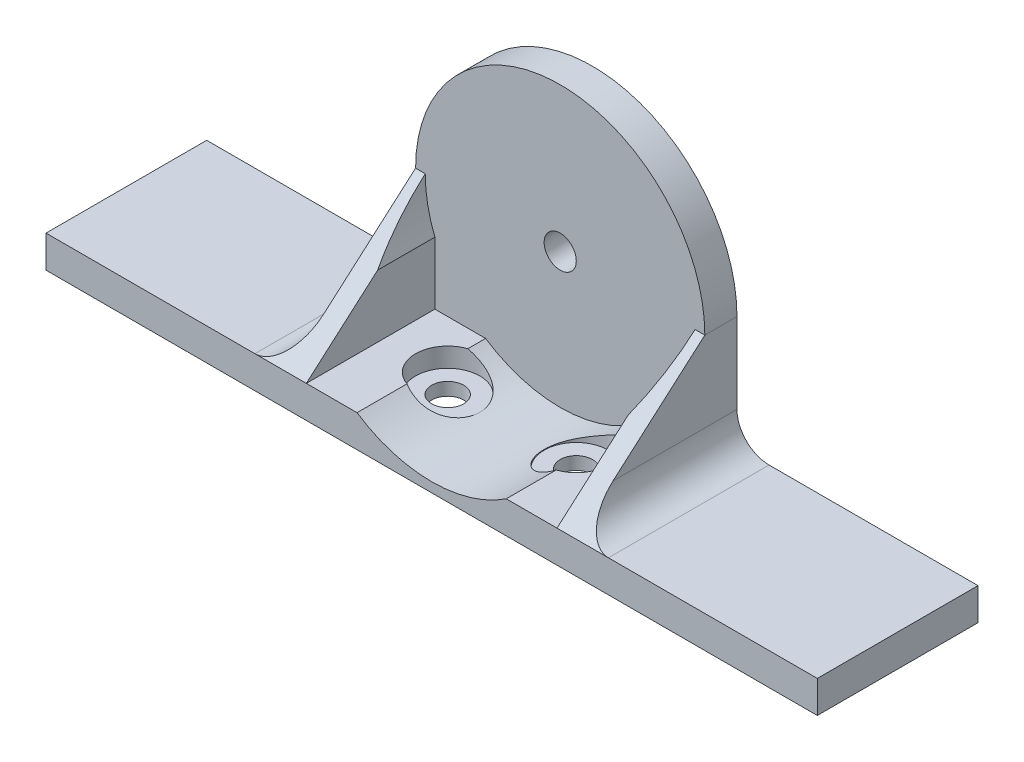
ISO-10303-21;
HEADER;
FILE_DESCRIPTION(('STEP AP214'),'2;1');
FILE_NAME('part.step','',(''),(''),'','','');
FILE_SCHEMA(('AUTOMOTIVE_DESIGN { 1 0 10303 214 1 1 1 1 }'));
ENDSEC;
DATA;
#1=APPLICATION_CONTEXT('core data for automotive mechanical design processes');
#2=APPLICATION_PROTOCOL_DEFINITION('international standard','automotive_design',2000,#1);
#3=PRODUCT_CONTEXT('',#1,'mechanical');
#4=PRODUCT('Part','Part','',(#3));
#5=PRODUCT_RELATED_PRODUCT_CATEGORY('part','',(#4));
#6=PRODUCT_DEFINITION_FORMATION('','',#4);
#7=PRODUCT_DEFINITION_CONTEXT('part definition',#1,'design');
#8=PRODUCT_DEFINITION('design','',#6,#7);
#9=PRODUCT_DEFINITION_SHAPE('','',#8);
#10=(LENGTH_UNIT() NAMED_UNIT(*) SI_UNIT(.MILLI.,.METRE.));
#11=(NAMED_UNIT(*) PLANE_ANGLE_UNIT() SI_UNIT($,.RADIAN.));
#12=(NAMED_UNIT(*) SI_UNIT($,.STERADIAN.) SOLID_ANGLE_UNIT());
#13=UNCERTAINTY_MEASURE_WITH_UNIT(LENGTH_MEASURE(1.E-05),#10,'distance_accuracy_value','');
#14=(GEOMETRIC_REPRESENTATION_CONTEXT(3) GLOBAL_UNCERTAINTY_ASSIGNED_CONTEXT((#13)) GLOBAL_UNIT_ASSIGNED_CONTEXT((#10,
#11,#12)) REPRESENTATION_CONTEXT('',''));
#15=CARTESIAN_POINT('',(0.,0.,0.));
#16=DIRECTION('',(0.,0.,1.));
#17=DIRECTION('',(1.,0.,0.));
#18=AXIS2_PLACEMENT_3D('',#15,#16,#17);
#19=CARTESIAN_POINT('',(-60.,-17.5,0.));
#20=DIRECTION('',(0.,-1.,0.));
#21=DIRECTION('',(0.,0.,-1.));
#22=AXIS2_PLACEMENT_3D('',#19,#20,#21);
#23=PLANE('',#22);
#24=DIRECTION('',(0.,0.,-1.));
#25=VECTOR('',#24,1.);
#26=CARTESIAN_POINT('',(-11.6081867662439,-17.5,25.));
#27=LINE('',#26,#25);
#28=CARTESIAN_POINT('',(-11.6081867662439,-17.5,5.));
#29=VERTEX_POINT('',#28);
#30=CARTESIAN_POINT('',(-11.6081867662439,-17.5,7.76568533736109));
#31=VERTEX_POINT('',#30);
#32=EDGE_CURVE('E327',#29,#31,#27,.F.);
#33=ORIENTED_EDGE('',*,*,#32,.F.);
#34=DIRECTION('',(-1.,0.,0.));
#35=VECTOR('',#34,1.);
#36=CARTESIAN_POINT('',(-22.5,-17.5,5.));
#37=LINE('',#36,#35);
#38=CARTESIAN_POINT('',(-19.5,-17.5,5.));
#39=VERTEX_POINT('',#38);
#40=EDGE_CURVE('E216',#29,#39,#37,.T.);
#41=ORIENTED_EDGE('',*,*,#40,.T.);
#42=DIRECTION('',(0.,0.,1.));
#43=VECTOR('',#42,1.);
#44=CARTESIAN_POINT('',(-19.5,-17.5,5.));
#45=LINE('',#44,#43);
#46=CARTESIAN_POINT('',(-19.5,-17.5,25.));
#47=VERTEX_POINT('',#46);
#48=EDGE_CURVE('E210',#39,#47,#45,.T.);
#49=ORIENTED_EDGE('',*,*,#48,.T.);
#50=DIRECTION('',(1.,0.,0.));
#51=VECTOR('',#50,1.);
#52=CARTESIAN_POINT('',(-60.,-17.5,25.));
#53=LINE('',#52,#51);
#54=CARTESIAN_POINT('',(-11.6081867662439,-17.5,25.));
#55=VERTEX_POINT('',#54);
#56=EDGE_CURVE('E254',#47,#55,#53,.T.);
#57=ORIENTED_EDGE('',*,*,#56,.T.);
#58=CARTESIAN_POINT('',(-11.6081867662439,-17.5,17.2343146626389));
#59=VERTEX_POINT('',#58);
#60=EDGE_CURVE('E438',#59,#55,#27,.F.);
#61=ORIENTED_EDGE('',*,*,#60,.F.);
#62=CARTESIAN_POINT('',(-10.,-17.5,12.5));
#63=DIRECTION('',(0.,-1.,0.));
#64=DIRECTION('',(0.,0.,-1.));
#65=AXIS2_PLACEMENT_3D('',#62,#63,#64);
#66=CIRCLE('',#65,5.);
#67=EDGE_CURVE('E221',#31,#59,#66,.F.);
#68=ORIENTED_EDGE('',*,*,#67,.F.);
#69=EDGE_LOOP('',(#33,#41,#49,#57,#61,#68));
#70=FACE_BOUND('',#69,.T.);
#71=ADVANCED_FACE('F39',(#70),#23,.F.);
#72=CARTESIAN_POINT('',(-10.,22.5,12.5));
#73=DIRECTION('',(0.,-1.,0.));
#74=DIRECTION('',(0.,0.,-1.));
#75=AXIS2_PLACEMENT_3D('',#72,#73,#74);
#76=CYLINDRICAL_SURFACE('',#75,5.);
#77=CARTESIAN_POINT('',(-10.,-20.5,12.5));
#78=DIRECTION('',(0.,-1.,0.));
#79=DIRECTION('',(0.,0.,-1.));
#80=AXIS2_PLACEMENT_3D('',#77,#78,#79);
#81=CIRCLE('',#80,5.);
#82=CARTESIAN_POINT('',(-10.,-20.5,7.50000000000001));
#83=VERTEX_POINT('',#82);
#84=EDGE_CURVE('E297',#83,#83,#81,.F.);
#85=ORIENTED_EDGE('',*,*,#84,.F.);
#86=EDGE_LOOP('',(#85));
#87=FACE_BOUND('',#86,.T.);
#88=CARTESIAN_POINT('',(-11.6081867662439,-17.5,7.76568533736109));
#89=CARTESIAN_POINT('',(-11.4375345080288,-17.6132401353149,7.70772130768553));
#90=CARTESIAN_POINT('',(-11.2630091727208,-17.7253712821928,7.65872713448555));
#91=CARTESIAN_POINT('',(-10.9073905192815,-17.9463735095857,7.57964568088784));
#92=CARTESIAN_POINT('',(-10.7262884992566,-18.0552398949962,7.5495844928465));
#93=CARTESIAN_POINT('',(-10.3580415413399,-18.2690086123099,7.50937786053708));
#94=CARTESIAN_POINT('',(-10.1708662604285,-18.3738824076262,7.49935618829404));
#95=CARTESIAN_POINT('',(-9.79351174021264,-18.5777564076377,7.50070725609247));
#96=CARTESIAN_POINT('',(-9.6033343937213,-18.6767601397546,7.51206701046821));
#97=CARTESIAN_POINT('',(-9.25075773438875,-18.8535505022338,7.55376363813038));
#98=CARTESIAN_POINT('',(-9.08846783724289,-18.9322929450681,7.58100054457933));
#99=CARTESIAN_POINT('',(-8.76494315087312,-19.0842260446967,7.65210866966691));
#100=CARTESIAN_POINT('',(-8.60370815558617,-19.1574178172472,7.69597653457618));
#101=CARTESIAN_POINT('',(-8.28469840408489,-19.2975132608588,7.80044589529361));
#102=CARTESIAN_POINT('',(-8.12691317396856,-19.3644388884449,7.86098578804088));
#103=CARTESIAN_POINT('',(-7.81620615605804,-19.4919241173014,7.99889828074545));
#104=CARTESIAN_POINT('',(-7.66328345381965,-19.5524849205346,8.0762676940362));
#105=CARTESIAN_POINT('',(-7.38613890562433,-19.658679552486,8.23509580740229));
#106=CARTESIAN_POINT('',(-7.26097613123558,-19.7052035715812,8.31432557386082));
#107=CARTESIAN_POINT('',(-7.01706893548761,-19.7933714543359,8.48450184266299));
#108=CARTESIAN_POINT('',(-6.89832364497143,-19.8350159797504,8.57544675268336));
#109=CARTESIAN_POINT('',(-6.66851697458718,-19.9134536211138,8.76854512361413));
#110=CARTESIAN_POINT('',(-6.55745836267542,-19.9502449937287,8.87070258825146));
#111=CARTESIAN_POINT('',(-6.34433274321556,-20.0190405423183,9.08547526066337));
#112=CARTESIAN_POINT('',(-6.24226525083162,-20.0510449764883,9.19808990387303));
#113=CARTESIAN_POINT('',(-6.05691625828496,-20.1077674345042,9.42244487188029));
#114=CARTESIAN_POINT('',(-5.972771375406,-20.1328802050712,9.53337383377719));
#115=CARTESIAN_POINT('',(-5.81368638670795,-20.1793935267141,9.76244139476929));
#116=CARTESIAN_POINT('',(-5.73874927165979,-20.2007928725597,9.880582317826));
#117=CARTESIAN_POINT('',(-5.59887579248388,-20.2400065508586,10.1230929850686));
#118=CARTESIAN_POINT('',(-5.53393228757043,-20.2578234459167,10.2474581967819));
#119=CARTESIAN_POINT('',(-5.41456655128792,-20.2900540963379,10.5016211109604));
#120=CARTESIAN_POINT('',(-5.36014817188253,-20.3044666061966,10.631420781256));
#121=CARTESIAN_POINT('',(-5.26379960284031,-20.3296537338692,10.891560155421));
#122=CARTESIAN_POINT('',(-5.22155033418001,-20.3405225366933,11.0217726985622));
#123=CARTESIAN_POINT('',(-5.14781803181256,-20.3593079260295,11.2854714023466));
#124=CARTESIAN_POINT('',(-5.11633889309744,-20.3672234445868,11.418958728643));
#125=CARTESIAN_POINT('',(-5.0644465597661,-20.3801888375641,11.6881530867144));
#126=CARTESIAN_POINT('',(-5.04402933062876,-20.3852397567978,11.8238592905874));
#127=CARTESIAN_POINT('',(-5.01441013436884,-20.3925458075517,12.0966157530786));
#128=CARTESIAN_POINT('',(-5.00521230735021,-20.3947999070146,12.2336664890524));
#129=CARTESIAN_POINT('',(-4.99814161551046,-20.3965338575992,12.5073591457146));
#130=CARTESIAN_POINT('',(-5.00020976376957,-20.3960281585772,12.6439994549546));
#131=CARTESIAN_POINT('',(-5.01551984682102,-20.3922686968898,12.9166651451284));
#132=CARTESIAN_POINT('',(-5.02876588654246,-20.3890139246641,13.0526902816961));
#133=CARTESIAN_POINT('',(-5.06631990869287,-20.3797148129057,13.3230548254907));
#134=CARTESIAN_POINT('',(-5.09062358050635,-20.3736715603982,13.4573948686699));
#135=CARTESIAN_POINT('',(-5.15009649845836,-20.3587191411752,13.7235350769801));
#136=CARTESIAN_POINT('',(-5.18526974685607,-20.3498089187704,13.8553342875356));
#137=CARTESIAN_POINT('',(-5.26616727488969,-20.3290242033995,14.1153466221362));
#138=CARTESIAN_POINT('',(-5.31188595020009,-20.3171512846735,14.2435616105655));
#139=CARTESIAN_POINT('',(-5.4134818585494,-20.2903170599912,14.4955823747452));
#140=CARTESIAN_POINT('',(-5.46936281483165,-20.2753546218278,14.6193865145069));
#141=CARTESIAN_POINT('',(-5.65152933389414,-20.2256302346052,14.9827401004168));
#142=CARTESIAN_POINT('',(-5.79243177170621,-20.1860083954562,15.2145282276361));
#143=CARTESIAN_POINT('',(-6.10844542778946,-20.0926350949264,15.6509820568319));
#144=CARTESIAN_POINT('',(-6.28364303590931,-20.03884783001,15.8555770271514));
#145=CARTESIAN_POINT('',(-6.66182804227834,-19.9163117701238,16.2319910811152));
#146=CARTESIAN_POINT('',(-6.86481753316591,-19.8475618482845,16.4038076943219));
#147=CARTESIAN_POINT('',(-7.2953061555763,-19.6934410535185,16.7138192936211));
#148=CARTESIAN_POINT('',(-7.52318061754952,-19.607793339698,16.8513535941981));
#149=CARTESIAN_POINT('',(-7.99255140863401,-19.4211966516131,17.0868420144358));
#150=CARTESIAN_POINT('',(-8.23404664127605,-19.3202489078972,17.1847993148693));
#151=CARTESIAN_POINT('',(-8.73707856620653,-19.0982509457631,17.3454749738797));
#152=CARTESIAN_POINT('',(-8.99898040677328,-18.976391756432,17.4059137845808));
#153=CARTESIAN_POINT('',(-9.5228322321516,-18.7189986330017,17.4842309207157));
#154=CARTESIAN_POINT('',(-9.78478175990088,-18.5834455777484,17.5020488527475));
#155=CARTESIAN_POINT('',(-10.1791972893186,-18.3686694064161,17.4986369075556));
#156=CARTESIAN_POINT('',(-10.3140767524584,-18.2932669608552,17.4919325021984));
#157=CARTESIAN_POINT('',(-10.5814699633379,-18.1399064863693,17.4678865762738));
#158=CARTESIAN_POINT('',(-10.7139833617684,-18.0619480848415,17.4505434982343));
#159=CARTESIAN_POINT('',(-10.9755497455679,-17.9042048075577,17.4056970625706));
#160=CARTESIAN_POINT('',(-11.1046126112647,-17.8244267215269,17.3782270421688));
#161=CARTESIAN_POINT('',(-11.3591778413429,-17.663291131667,17.313508438407));
#162=CARTESIAN_POINT('',(-11.4846816756527,-17.5819343039712,17.2762639591791));
#163=CARTESIAN_POINT('',(-11.6081867662439,-17.5,17.2343146626389));
#164=B_SPLINE_CURVE_WITH_KNOTS('',3,(#88,#89,#90,#91,#92,#93,#94,#95,#96,#97,#98,#99,#100,#101,
#102,#103,#104,#105,#106,#107,#108,#109,#110,#111,#112,#113,#114,#115,#116,#117,#118,#119,#120,
#121,#122,#123,#124,#125,#126,#127,#128,#129,#130,#131,#132,#133,#134,#135,#136,#137,#138,#139,
#140,#141,#142,#143,#144,#145,#146,#147,#148,#149,#150,#151,#152,#153,#154,#155,#156,#157,#158,
#159,#160,#161,#162,#163),.UNSPECIFIED.,.F.,.F.,(4,2,2,2,2,2,2,2,2,2,2,2,2,2,2,2,2,2,2,2,2,2,2,
2,2,2,2,2,2,2,2,2,2,2,2,2,2,4),(0.,0.638436207218285,1.27775035639756,1.92100111612904,
2.56386133390451,3.11035557236956,3.65673966566589,4.20113135121695,4.74542004589635,
5.21059635023806,5.67570949436088,6.14098926258487,6.60624392575077,7.03015998811005,
7.45421338050135,7.87796235063196,8.30186611129443,8.71335438276962,9.12499131109297,
9.53647800515841,9.94811649722532,10.357601791705,10.7672375295823,11.1767137151077,
11.5863408528264,11.9957507953609,12.4053110402904,13.223505498321,14.0437881522201,
14.8641326047381,15.6992397054322,16.5342796758609,17.4160633260542,18.2990957175071,
18.7627702133888,19.2265126061389,19.6887418266236,20.1507772744256),.UNSPECIFIED.);
#165=EDGE_CURVE('E430',#31,#59,#164,.T.);
#166=ORIENTED_EDGE('',*,*,#165,.F.);
#167=ORIENTED_EDGE('',*,*,#67,.T.);
#168=EDGE_LOOP('',(#166,#167));
#169=FACE_BOUND('',#168,.T.);
#170=ADVANCED_FACE('F385',(#87,#169),#76,.F.);
#171=CARTESIAN_POINT('',(10.,22.5,12.5));
#172=DIRECTION('',(0.,-1.,0.));
#173=DIRECTION('',(0.,0.,-1.));
#174=AXIS2_PLACEMENT_3D('',#171,#172,#173);
#175=CYLINDRICAL_SURFACE('',#174,5.00000000000001);
#176=CARTESIAN_POINT('',(9.99999999999999,-20.5,12.5));
#177=DIRECTION('',(0.,-1.,0.));
#178=DIRECTION('',(0.,0.,1.));
#179=AXIS2_PLACEMENT_3D('',#176,#177,#178);
#180=CIRCLE('',#179,5.);
#181=CARTESIAN_POINT('',(9.99999999999999,-20.5,17.5));
#182=VERTEX_POINT('',#181);
#183=EDGE_CURVE('E259',#182,#182,#180,.T.);
#184=ORIENTED_EDGE('',*,*,#183,.T.);
#185=EDGE_LOOP('',(#184));
#186=FACE_BOUND('',#185,.T.);
#187=CARTESIAN_POINT('',(11.6081867662439,-17.5,17.2343146626389));
#188=CARTESIAN_POINT('',(11.4375345080288,-17.6132401353149,17.2922786923145));
#189=CARTESIAN_POINT('',(11.2630091727208,-17.7253712821928,17.3412728655145));
#190=CARTESIAN_POINT('',(10.9073905192815,-17.9463735095857,17.4203543191122));
#191=CARTESIAN_POINT('',(10.7262884992566,-18.0552398949962,17.4504155071535));
#192=CARTESIAN_POINT('',(10.3580415413399,-18.2690086123099,17.4906221394629));
#193=CARTESIAN_POINT('',(10.1708662604285,-18.3738824076262,17.500643811706));
#194=CARTESIAN_POINT('',(9.79351174021264,-18.5777564076377,17.4992927439076));
#195=CARTESIAN_POINT('',(9.60333439372129,-18.6767601397546,17.4879329895318));
#196=CARTESIAN_POINT('',(9.25075773438875,-18.8535505022338,17.4462363618696));
#197=CARTESIAN_POINT('',(9.08846783724288,-18.9322929450681,17.4189994554207));
#198=CARTESIAN_POINT('',(8.76494315087312,-19.0842260446967,17.3478913303331));
#199=CARTESIAN_POINT('',(8.60370815558616,-19.1574178172472,17.3040234654238));
#200=CARTESIAN_POINT('',(8.28469840408488,-19.2975132608588,17.1995541047064));
#201=CARTESIAN_POINT('',(8.12691317396855,-19.3644388884449,17.1390142119591));
#202=CARTESIAN_POINT('',(7.81620615605803,-19.4919241173014,17.0011017192546));
#203=CARTESIAN_POINT('',(7.66328345381964,-19.5524849205346,16.9237323059638));
#204=CARTESIAN_POINT('',(7.38613890562432,-19.658679552486,16.7649041925977));
#205=CARTESIAN_POINT('',(7.26097613123557,-19.7052035715812,16.6856744261392));
#206=CARTESIAN_POINT('',(7.0170689354876,-19.7933714543359,16.515498157337));
#207=CARTESIAN_POINT('',(6.89832364497142,-19.8350159797504,16.4245532473167));
#208=CARTESIAN_POINT('',(6.66851697458717,-19.9134536211138,16.2314548763859));
#209=CARTESIAN_POINT('',(6.55745836267541,-19.9502449937287,16.1292974117486));
#210=CARTESIAN_POINT('',(6.34433274321555,-20.0190405423183,15.9145247393367));
#211=CARTESIAN_POINT('',(6.24226525083161,-20.0510449764883,15.801910096127));
#212=CARTESIAN_POINT('',(6.05691625828495,-20.1077674345042,15.5775551281197));
#213=CARTESIAN_POINT('',(5.97277137540599,-20.1328802050712,15.4666261662228));
#214=CARTESIAN_POINT('',(5.81368638670794,-20.179393526714,15.2375586052307));
#215=CARTESIAN_POINT('',(5.73874927165978,-20.2007928725597,15.119417682174));
#216=CARTESIAN_POINT('',(5.59887579248387,-20.2400065508586,14.8769070149314));
#217=CARTESIAN_POINT('',(5.53393228757042,-20.2578234459167,14.7525418032181));
#218=CARTESIAN_POINT('',(5.41456655128791,-20.2900540963379,14.4983788890396));
#219=CARTESIAN_POINT('',(5.36014817188252,-20.3044666061966,14.368579218744));
#220=CARTESIAN_POINT('',(5.2637996028403,-20.3296537338692,14.108439844579));
#221=CARTESIAN_POINT('',(5.22155033418,-20.3405225366933,13.9782273014378));
#222=CARTESIAN_POINT('',(5.14781803181255,-20.3593079260295,13.7145285976534));
#223=CARTESIAN_POINT('',(5.11633889309743,-20.3672234445868,13.581041271357));
#224=CARTESIAN_POINT('',(5.06444655976609,-20.3801888375641,13.3118469132857));
#225=CARTESIAN_POINT('',(5.04402933062875,-20.3852397567978,13.1761407094126));
#226=CARTESIAN_POINT('',(5.01441013436883,-20.3925458075517,12.9033842469214));
#227=CARTESIAN_POINT('',(5.0052123073502,-20.3947999070146,12.7663335109476));
#228=CARTESIAN_POINT('',(4.99814161551045,-20.3965338575992,12.4926408542854));
#229=CARTESIAN_POINT('',(5.00020976376956,-20.3960281585773,12.3560005450454));
#230=CARTESIAN_POINT('',(5.01551984682102,-20.3922686968898,12.0833348548716));
#231=CARTESIAN_POINT('',(5.02876588654245,-20.3890139246641,11.9473097183039));
#232=CARTESIAN_POINT('',(5.06631990869286,-20.3797148129057,11.6769451745093));
#233=CARTESIAN_POINT('',(5.09062358050635,-20.3736715603982,11.5426051313301));
#234=CARTESIAN_POINT('',(5.15009649845836,-20.3587191411752,11.2764649230199));
#235=CARTESIAN_POINT('',(5.18526974685606,-20.3498089187704,11.1446657124644));
#236=CARTESIAN_POINT('',(5.26616727488968,-20.3290242033995,10.8846533778638));
#237=CARTESIAN_POINT('',(5.31188595020009,-20.3171512846735,10.7564383894345));
#238=CARTESIAN_POINT('',(5.4134818585494,-20.2903170599912,10.5044176252548));
#239=CARTESIAN_POINT('',(5.46936281483165,-20.2753546218278,10.3806134854931));
#240=CARTESIAN_POINT('',(5.65152933389414,-20.2256302346052,10.0172598995832));
#241=CARTESIAN_POINT('',(5.79243177170621,-20.1860083954562,9.78547177236387));
#242=CARTESIAN_POINT('',(6.10844542778946,-20.0926350949264,9.34901794316813));
#243=CARTESIAN_POINT('',(6.28364303590931,-20.03884783001,9.14442297284861));
#244=CARTESIAN_POINT('',(6.66182804227834,-19.9163117701238,8.7680089188848));
#245=CARTESIAN_POINT('',(6.86481753316591,-19.8475618482845,8.59619230567808));
#246=CARTESIAN_POINT('',(7.2953061555763,-19.6934410535185,8.2861807063789));
#247=CARTESIAN_POINT('',(7.52318061754953,-19.607793339698,8.14864640580191));
#248=CARTESIAN_POINT('',(7.99255140863401,-19.4211966516131,7.91315798556417));
#249=CARTESIAN_POINT('',(8.23404664127605,-19.3202489078972,7.81520068513071));
#250=CARTESIAN_POINT('',(8.73707856620654,-19.0982509457631,7.65452502612029));
#251=CARTESIAN_POINT('',(8.9989804067733,-18.976391756432,7.59408621541925));
#252=CARTESIAN_POINT('',(9.52283223215161,-18.7189986330017,7.51576907928427));
#253=CARTESIAN_POINT('',(9.78478175990089,-18.5834455777483,7.49795114725246));
#254=CARTESIAN_POINT('',(10.1791972893186,-18.3686694064161,7.50136309244446));
#255=CARTESIAN_POINT('',(10.3140767524585,-18.2932669608552,7.50806749780165));
#256=CARTESIAN_POINT('',(10.5814699633379,-18.1399064863693,7.53211342372616));
#257=CARTESIAN_POINT('',(10.7139833617684,-18.0619480848415,7.54945650176571));
#258=CARTESIAN_POINT('',(10.9755497455679,-17.9042048075577,7.59430293742945));
#259=CARTESIAN_POINT('',(11.1046126112647,-17.8244267215269,7.62177295783118));
#260=CARTESIAN_POINT('',(11.359177841343,-17.663291131667,7.68649156159302));
#261=CARTESIAN_POINT('',(11.4846816756527,-17.5819343039712,7.72373604082095));
#262=CARTESIAN_POINT('',(11.6081867662439,-17.5,7.76568533736108));
#263=B_SPLINE_CURVE_WITH_KNOTS('',3,(#187,#188,#189,#190,#191,#192,#193,#194,#195,#196,#197,
#198,#199,#200,#201,#202,#203,#204,#205,#206,#207,#208,#209,#210,#211,#212,#213,#214,#215,#216,
#217,#218,#219,#220,#221,#222,#223,#224,#225,#226,#227,#228,#229,#230,#231,#232,#233,#234,#235,
#236,#237,#238,#239,#240,#241,#242,#243,#244,#245,#246,#247,#248,#249,#250,#251,#252,#253,#254,
#255,#256,#257,#258,#259,#260,#261,#262),.UNSPECIFIED.,.F.,.F.,(4,2,2,2,2,2,2,2,2,2,2,2,2,2,2,2,
2,2,2,2,2,2,2,2,2,2,2,2,2,2,2,2,2,2,2,2,2,4),(0.,0.638436207218287,1.27775035639756,
1.92100111612905,2.56386133390451,3.11035557236956,3.6567396656659,4.20113135121696,
4.74542004589636,5.21059635023808,5.67570949436089,6.14098926258488,6.60624392575078,
7.03015998811007,7.45421338050137,7.87796235063198,8.30186611129445,8.71335438276964,
9.12499131109298,9.53647800515842,9.94811649722534,10.357601791705,10.7672375295823,
11.1767137151078,11.5863408528264,11.9957507953609,12.4053110402904,13.2235054983211,
14.0437881522201,14.8641326047381,15.6992397054323,16.5342796758609,17.4160633260542,
18.2990957175072,18.7627702133889,19.2265126061389,19.6887418266236,20.1507772744257),.UNSPECIFIED.);
#264=CARTESIAN_POINT('',(11.6081867662439,-17.5,17.2343146626389));
#265=VERTEX_POINT('',#264);
#266=CARTESIAN_POINT('',(11.6081867662439,-17.5,7.76568533736106));
#267=VERTEX_POINT('',#266);
#268=EDGE_CURVE('E440',#265,#267,#263,.T.);
#269=ORIENTED_EDGE('',*,*,#268,.F.);
#270=CARTESIAN_POINT('',(10.,-17.5,12.5));
#271=DIRECTION('',(0.,-1.,0.));
#272=DIRECTION('',(0.,0.,-1.));
#273=AXIS2_PLACEMENT_3D('',#270,#271,#272);
#274=CIRCLE('',#273,5.00000000000001);
#275=EDGE_CURVE('E300',#265,#267,#274,.F.);
#276=ORIENTED_EDGE('',*,*,#275,.T.);
#277=EDGE_LOOP('',(#269,#276));
#278=FACE_BOUND('',#277,.T.);
#279=ADVANCED_FACE('F392',(#186,#278),#175,.F.);
#280=CARTESIAN_POINT('',(60.,-17.5,25.));
#281=DIRECTION('',(0.,-1.,0.));
#282=DIRECTION('',(0.,0.,-1.));
#283=AXIS2_PLACEMENT_3D('',#280,#281,#282);
#284=PLANE('',#283);
#285=DIRECTION('',(0.,0.,-1.));
#286=VECTOR('',#285,1.);
#287=CARTESIAN_POINT('',(11.6081867662439,-17.5,25.));
#288=LINE('',#287,#286);
#289=CARTESIAN_POINT('',(11.6081867662439,-17.5,25.));
#290=VERTEX_POINT('',#289);
#291=EDGE_CURVE('E439',#290,#265,#288,.T.);
#292=ORIENTED_EDGE('',*,*,#291,.F.);
#293=DIRECTION('',(-1.,0.,0.));
#294=VECTOR('',#293,1.);
#295=CARTESIAN_POINT('',(60.,-17.5,25.));
#296=LINE('',#295,#294);
#297=CARTESIAN_POINT('',(19.5,-17.5,25.));
#298=VERTEX_POINT('',#297);
#299=EDGE_CURVE('E234',#298,#290,#296,.T.);
#300=ORIENTED_EDGE('',*,*,#299,.F.);
#301=DIRECTION('',(0.,0.,-1.));
#302=VECTOR('',#301,1.);
#303=CARTESIAN_POINT('',(19.5,-17.5,25.));
#304=LINE('',#303,#302);
#305=CARTESIAN_POINT('',(19.5,-17.5,5.));
#306=VERTEX_POINT('',#305);
#307=EDGE_CURVE('E195',#298,#306,#304,.T.);
#308=ORIENTED_EDGE('',*,*,#307,.T.);
#309=CARTESIAN_POINT('',(11.6081867662439,-17.5,5.));
#310=VERTEX_POINT('',#309);
#311=EDGE_CURVE('E220',#306,#310,#37,.T.);
#312=ORIENTED_EDGE('',*,*,#311,.T.);
#313=EDGE_CURVE('E781',#267,#310,#288,.T.);
#314=ORIENTED_EDGE('',*,*,#313,.F.);
#315=ORIENTED_EDGE('',*,*,#275,.F.);
#316=EDGE_LOOP('',(#292,#300,#308,#312,#314,#315));
#317=FACE_BOUND('',#316,.T.);
#318=ADVANCED_FACE('F464',(#317),#284,.F.);
#319=CARTESIAN_POINT('',(-19.5,-17.5,25.));
#320=DIRECTION('',(0.,0.752576694706878,0.658504607868518));
#321=DIRECTION('',(0.,-0.658504607868518,0.752576694706878));
#322=AXIS2_PLACEMENT_3D('',#319,#320,#321);
#323=PLANE('',#322);
#324=DIRECTION('',(0.,0.658504607868518,-0.752576694706878));
#325=VECTOR('',#324,1.);
#326=CARTESIAN_POINT('',(-19.5,-17.5,25.));
#327=LINE('',#326,#325);
#328=CARTESIAN_POINT('',(-19.5,-7.79422863405994,13.9076898674971));
#329=VERTEX_POINT('',#328);
#330=EDGE_CURVE('E204',#47,#329,#327,.T.);
#331=ORIENTED_EDGE('',*,*,#330,.T.);
#332=CARTESIAN_POINT('',(0.,0.,5.));
#333=DIRECTION('',(0.,0.752576694706878,0.658504607868518));
#334=DIRECTION('',(0.,0.658504607868518,-0.752576694706878));
#335=AXIS2_PLACEMENT_3D('',#332,#333,#334);
#336=ELLIPSE('',#335,31.890437438204,21.);
#337=CARTESIAN_POINT('',(-21.,0.,5.));
#338=VERTEX_POINT('',#337);
#339=EDGE_CURVE('E369',#329,#338,#336,.F.);
#340=ORIENTED_EDGE('',*,*,#339,.T.);
#341=DIRECTION('',(-1.,0.,0.));
#342=VECTOR('',#341,1.);
#343=CARTESIAN_POINT('',(-19.5,0.,5.));
#344=LINE('',#343,#342);
#345=CARTESIAN_POINT('',(-22.5,0.,5.));
#346=VERTEX_POINT('',#345);
#347=EDGE_CURVE('E213',#338,#346,#344,.T.);
#348=ORIENTED_EDGE('',*,*,#347,.T.);
#349=DIRECTION('',(0.,0.658504607868518,-0.752576694706878));
#350=VECTOR('',#349,1.);
#351=CARTESIAN_POINT('',(-22.5,-17.5,25.));
#352=LINE('',#351,#350);
#353=CARTESIAN_POINT('',(-22.5,-12.5,19.2857142857143));
#354=VERTEX_POINT('',#353);
#355=EDGE_CURVE('E198',#354,#346,#352,.T.);
#356=ORIENTED_EDGE('',*,*,#355,.F.);
#357=CARTESIAN_POINT('',(-27.5,-12.5,19.2857142857143));
#358=DIRECTION('',(0.,0.752576694706878,0.658504607868518));
#359=DIRECTION('',(0.,-0.658504607868518,0.752576694706878));
#360=AXIS2_PLACEMENT_3D('',#357,#358,#359);
#361=ELLIPSE('',#360,7.59296129481047,5.);
#362=CARTESIAN_POINT('',(-27.5,-17.5,25.));
#363=VERTEX_POINT('',#362);
#364=EDGE_CURVE('E316',#354,#363,#361,.F.);
#365=ORIENTED_EDGE('',*,*,#364,.T.);
#366=DIRECTION('',(-1.,0.,0.));
#367=VECTOR('',#366,1.);
#368=CARTESIAN_POINT('',(-19.5,-17.5,25.));
#369=LINE('',#368,#367);
#370=EDGE_CURVE('E55',#47,#363,#369,.T.);
#371=ORIENTED_EDGE('',*,*,#370,.F.);
#372=EDGE_LOOP('',(#331,#340,#348,#356,#365,#371));
#373=FACE_BOUND('',#372,.T.);
#374=ADVANCED_FACE('F365',(#373),#323,.T.);
#375=CARTESIAN_POINT('',(-19.5,0.,0.));
#376=DIRECTION('',(-1.,0.,0.));
#377=DIRECTION('',(0.,0.,1.));
#378=AXIS2_PLACEMENT_3D('',#375,#376,#377);
#379=PLANE('',#378);
#380=DIRECTION('',(0.,0.,-1.));
#381=VECTOR('',#380,1.);
#382=CARTESIAN_POINT('',(-19.5,-7.79422863405994,25.));
#383=LINE('',#382,#381);
#384=CARTESIAN_POINT('',(-19.5,-7.79422863405994,5.));
#385=VERTEX_POINT('',#384);
#386=EDGE_CURVE('E173',#329,#385,#383,.T.);
#387=ORIENTED_EDGE('',*,*,#386,.F.);
#388=ORIENTED_EDGE('',*,*,#330,.F.);
#389=ORIENTED_EDGE('',*,*,#48,.F.);
#390=DIRECTION('',(0.,-1.,0.));
#391=VECTOR('',#390,1.);
#392=CARTESIAN_POINT('',(-19.5,0.,5.));
#393=LINE('',#392,#391);
#394=EDGE_CURVE('E207',#385,#39,#393,.T.);
#395=ORIENTED_EDGE('',*,*,#394,.F.);
#396=EDGE_LOOP('',(#387,#388,#389,#395));
#397=FACE_BOUND('',#396,.T.);
#398=ADVANCED_FACE('F458',(#397),#379,.F.);
#399=CARTESIAN_POINT('',(19.5,0.,5.));
#400=DIRECTION('',(0.,0.752576694706878,0.658504607868518));
#401=DIRECTION('',(0.,-0.658504607868518,0.752576694706878));
#402=AXIS2_PLACEMENT_3D('',#399,#400,#401);
#403=PLANE('',#402);
#404=DIRECTION('',(1.,0.,0.));
#405=VECTOR('',#404,1.);
#406=CARTESIAN_POINT('',(19.5,0.,5.));
#407=LINE('',#406,#405);
#408=CARTESIAN_POINT('',(21.,0.,5.));
#409=VERTEX_POINT('',#408);
#410=CARTESIAN_POINT('',(22.5,0.,5.));
#411=VERTEX_POINT('',#410);
#412=EDGE_CURVE('E182',#409,#411,#407,.T.);
#413=ORIENTED_EDGE('',*,*,#412,.F.);
#414=CARTESIAN_POINT('',(0.,0.,5.));
#415=DIRECTION('',(0.,0.752576694706878,0.658504607868518));
#416=DIRECTION('',(0.,0.658504607868518,-0.752576694706878));
#417=AXIS2_PLACEMENT_3D('',#414,#415,#416);
#418=ELLIPSE('',#417,31.890437438204,21.);
#419=CARTESIAN_POINT('',(19.5,-7.79422863405994,13.9076898674971));
#420=VERTEX_POINT('',#419);
#421=EDGE_CURVE('E164',#409,#420,#418,.F.);
#422=ORIENTED_EDGE('',*,*,#421,.T.);
#423=DIRECTION('',(0.,-0.658504607868518,0.752576694706878));
#424=VECTOR('',#423,1.);
#425=CARTESIAN_POINT('',(19.5,0.,5.));
#426=LINE('',#425,#424);
#427=EDGE_CURVE('E200',#420,#298,#426,.T.);
#428=ORIENTED_EDGE('',*,*,#427,.T.);
#429=DIRECTION('',(1.,0.,0.));
#430=VECTOR('',#429,1.);
#431=CARTESIAN_POINT('',(19.5,-17.5,25.));
#432=LINE('',#431,#430);
#433=CARTESIAN_POINT('',(27.5,-17.5,25.));
#434=VERTEX_POINT('',#433);
#435=EDGE_CURVE('E194',#298,#434,#432,.T.);
#436=ORIENTED_EDGE('',*,*,#435,.T.);
#437=CARTESIAN_POINT('',(27.5,-12.5,19.2857142857143));
#438=DIRECTION('',(0.,0.752576694706878,0.658504607868518));
#439=DIRECTION('',(0.,0.658504607868518,-0.752576694706878));
#440=AXIS2_PLACEMENT_3D('',#437,#438,#439);
#441=ELLIPSE('',#440,7.59296129481047,5.);
#442=CARTESIAN_POINT('',(22.5,-12.5,19.2857142857143));
#443=VERTEX_POINT('',#442);
#444=EDGE_CURVE('E48',#434,#443,#441,.F.);
#445=ORIENTED_EDGE('',*,*,#444,.T.);
#446=DIRECTION('',(0.,-0.658504607868518,0.752576694706878));
#447=VECTOR('',#446,1.);
#448=CARTESIAN_POINT('',(22.5,0.,5.));
#449=LINE('',#448,#447);
#450=EDGE_CURVE('E193',#411,#443,#449,.T.);
#451=ORIENTED_EDGE('',*,*,#450,.F.);
#452=EDGE_LOOP('',(#413,#422,#428,#436,#445,#451));
#453=FACE_BOUND('',#452,.T.);
#454=ADVANCED_FACE('F191',(#453),#403,.T.);
#455=CARTESIAN_POINT('',(19.5,0.,0.));
#456=DIRECTION('',(-1.,0.,0.));
#457=DIRECTION('',(0.,0.,1.));
#458=AXIS2_PLACEMENT_3D('',#455,#456,#457);
#459=PLANE('',#458);
#460=ORIENTED_EDGE('',*,*,#427,.F.);
#461=DIRECTION('',(0.,0.,-1.));
#462=VECTOR('',#461,1.);
#463=CARTESIAN_POINT('',(19.5,-7.79422863405994,25.));
#464=LINE('',#463,#462);
#465=CARTESIAN_POINT('',(19.5,-7.79422863405994,5.));
#466=VERTEX_POINT('',#465);
#467=EDGE_CURVE('E169',#420,#466,#464,.T.);
#468=ORIENTED_EDGE('',*,*,#467,.T.);
#469=DIRECTION('',(0.,1.,0.));
#470=VECTOR('',#469,1.);
#471=CARTESIAN_POINT('',(19.5,-17.5,5.));
#472=LINE('',#471,#470);
#473=EDGE_CURVE('E186',#306,#466,#472,.T.);
#474=ORIENTED_EDGE('',*,*,#473,.F.);
#475=ORIENTED_EDGE('',*,*,#307,.F.);
#476=EDGE_LOOP('',(#460,#468,#474,#475));
#477=FACE_BOUND('',#476,.T.);
#478=ADVANCED_FACE('F451',(#477),#459,.T.);
#479=DIRECTION('',(-1.,0.,0.));
#480=VECTOR('',#479,1.);
#481=CARTESIAN_POINT('',(60.,-17.5,0.));
#482=LINE('',#481,#480);
#483=CARTESIAN_POINT('',(60.,-17.5,0.));
#484=VERTEX_POINT('',#483);
#485=CARTESIAN_POINT('',(27.5,-17.5,0.));
#486=VERTEX_POINT('',#485);
#487=EDGE_CURVE('E238',#484,#486,#482,.T.);
#488=ORIENTED_EDGE('',*,*,#487,.T.);
#489=DIRECTION('',(0.,0.,1.));
#490=VECTOR('',#489,1.);
#491=CARTESIAN_POINT('',(27.5,-17.5,25.));
#492=LINE('',#491,#490);
#493=EDGE_CURVE('E309',#486,#434,#492,.T.);
#494=ORIENTED_EDGE('',*,*,#493,.T.);
#495=CARTESIAN_POINT('',(60.,-17.5,25.));
#496=VERTEX_POINT('',#495);
#497=EDGE_CURVE('E235',#496,#434,#296,.T.);
#498=ORIENTED_EDGE('',*,*,#497,.F.);
#499=DIRECTION('',(0.,0.,1.));
#500=VECTOR('',#499,1.);
#501=CARTESIAN_POINT('',(60.,-17.5,25.));
#502=LINE('',#501,#500);
#503=EDGE_CURVE('E232',#484,#496,#502,.T.);
#504=ORIENTED_EDGE('',*,*,#503,.F.);
#505=EDGE_LOOP('',(#488,#494,#498,#504));
#506=FACE_BOUND('',#505,.T.);
#507=ADVANCED_FACE('F336',(#506),#284,.F.);
#508=CARTESIAN_POINT('',(22.5,0.,25.));
#509=DIRECTION('',(-1.,0.,0.));
#510=DIRECTION('',(0.,0.,1.));
#511=AXIS2_PLACEMENT_3D('',#508,#509,#510);
#512=PLANE('',#511);
#513=ORIENTED_EDGE('',*,*,#450,.T.);
#514=DIRECTION('',(0.,0.,1.));
#515=VECTOR('',#514,1.);
#516=CARTESIAN_POINT('',(22.5,-12.5,0.));
#517=LINE('',#516,#515);
#518=CARTESIAN_POINT('',(22.5,-12.5,0.));
#519=VERTEX_POINT('',#518);
#520=EDGE_CURVE('E312',#443,#519,#517,.F.);
#521=ORIENTED_EDGE('',*,*,#520,.T.);
#522=DIRECTION('',(0.,1.,0.));
#523=VECTOR('',#522,1.);
#524=CARTESIAN_POINT('',(22.5,0.,0.));
#525=LINE('',#524,#523);
#526=CARTESIAN_POINT('',(22.5,0.,0.));
#527=VERTEX_POINT('',#526);
#528=EDGE_CURVE('E284',#519,#527,#525,.T.);
#529=ORIENTED_EDGE('',*,*,#528,.T.);
#530=DIRECTION('',(0.,0.,-1.));
#531=VECTOR('',#530,1.);
#532=CARTESIAN_POINT('',(22.5,0.,25.));
#533=LINE('',#532,#531);
#534=EDGE_CURVE('E291',#411,#527,#533,.T.);
#535=ORIENTED_EDGE('',*,*,#534,.F.);
#536=EDGE_LOOP('',(#513,#521,#529,#535));
#537=FACE_BOUND('',#536,.T.);
#538=ADVANCED_FACE('F325',(#537),#512,.F.);
#539=CARTESIAN_POINT('',(-22.5,0.,25.));
#540=DIRECTION('',(1.,0.,0.));
#541=DIRECTION('',(0.,0.,-1.));
#542=AXIS2_PLACEMENT_3D('',#539,#540,#541);
#543=PLANE('',#542);
#544=DIRECTION('',(0.,-1.,0.));
#545=VECTOR('',#544,1.);
#546=CARTESIAN_POINT('',(-22.5,0.,0.));
#547=LINE('',#546,#545);
#548=CARTESIAN_POINT('',(-22.5,0.,0.));
#549=VERTEX_POINT('',#548);
#550=CARTESIAN_POINT('',(-22.5,-12.5,0.));
#551=VERTEX_POINT('',#550);
#552=EDGE_CURVE('E280',#549,#551,#547,.T.);
#553=ORIENTED_EDGE('',*,*,#552,.T.);
#554=DIRECTION('',(0.,0.,-1.));
#555=VECTOR('',#554,1.);
#556=CARTESIAN_POINT('',(-22.5,-12.5,25.));
#557=LINE('',#556,#555);
#558=EDGE_CURVE('E307',#551,#354,#557,.F.);
#559=ORIENTED_EDGE('',*,*,#558,.T.);
#560=ORIENTED_EDGE('',*,*,#355,.T.);
#561=DIRECTION('',(0.,0.,-1.));
#562=VECTOR('',#561,1.);
#563=CARTESIAN_POINT('',(-22.5,0.,25.));
#564=LINE('',#563,#562);
#565=EDGE_CURVE('E283',#346,#549,#564,.T.);
#566=ORIENTED_EDGE('',*,*,#565,.T.);
#567=EDGE_LOOP('',(#553,#559,#560,#566));
#568=FACE_BOUND('',#567,.T.);
#569=ADVANCED_FACE('F359',(#568),#543,.F.);
#570=CARTESIAN_POINT('',(0.,0.,25.));
#571=DIRECTION('',(0.,0.,-1.));
#572=DIRECTION('',(-1.,0.,0.));
#573=AXIS2_PLACEMENT_3D('',#570,#571,#572);
#574=CYLINDRICAL_SURFACE('',#573,22.5);
#575=CARTESIAN_POINT('',(0.,0.,5.));
#576=DIRECTION('',(0.,0.,1.));
#577=DIRECTION('',(1.,0.,0.));
#578=AXIS2_PLACEMENT_3D('',#575,#576,#577);
#579=CIRCLE('',#578,22.5);
#580=EDGE_CURVE('E257',#411,#346,#579,.T.);
#581=ORIENTED_EDGE('',*,*,#580,.F.);
#582=ORIENTED_EDGE('',*,*,#534,.T.);
#583=CARTESIAN_POINT('',(0.,0.,0.));
#584=DIRECTION('',(0.,0.,1.));
#585=DIRECTION('',(1.,0.,0.));
#586=AXIS2_PLACEMENT_3D('',#583,#584,#585);
#587=CIRCLE('',#586,22.5);
#588=EDGE_CURVE('E294',#527,#549,#587,.T.);
#589=ORIENTED_EDGE('',*,*,#588,.T.);
#590=ORIENTED_EDGE('',*,*,#565,.F.);
#591=EDGE_LOOP('',(#581,#582,#589,#590));
#592=FACE_BOUND('',#591,.T.);
#593=ADVANCED_FACE('F371',(#592),#574,.T.);
#594=CARTESIAN_POINT('',(0.,0.,25.));
#595=DIRECTION('',(0.,0.,1.));
#596=DIRECTION('',(1.,0.,0.));
#597=AXIS2_PLACEMENT_3D('',#594,#595,#596);
#598=PLANE('',#597);
#599=ORIENTED_EDGE('',*,*,#299,.T.);
#600=CARTESIAN_POINT('',(0.,0.,25.));
#601=DIRECTION('',(0.,0.,1.));
#602=DIRECTION('',(1.,0.,0.));
#603=AXIS2_PLACEMENT_3D('',#600,#601,#602);
#604=CIRCLE('',#603,21.);
#605=EDGE_CURVE('E174',#55,#290,#604,.T.);
#606=ORIENTED_EDGE('',*,*,#605,.F.);
#607=ORIENTED_EDGE('',*,*,#56,.F.);
#608=ORIENTED_EDGE('',*,*,#370,.T.);
#609=CARTESIAN_POINT('',(-60.,-17.5,25.));
#610=VERTEX_POINT('',#609);
#611=EDGE_CURVE('E255',#610,#363,#53,.T.);
#612=ORIENTED_EDGE('',*,*,#611,.F.);
#613=DIRECTION('',(0.,1.,0.));
#614=VECTOR('',#613,1.);
#615=CARTESIAN_POINT('',(-60.,-22.5,25.));
#616=LINE('',#615,#614);
#617=CARTESIAN_POINT('',(-60.,-22.5,25.));
#618=VERTEX_POINT('',#617);
#619=EDGE_CURVE('E247',#618,#610,#616,.T.);
#620=ORIENTED_EDGE('',*,*,#619,.F.);
#621=DIRECTION('',(1.,0.,0.));
#622=VECTOR('',#621,1.);
#623=CARTESIAN_POINT('',(-22.5,-22.5,25.));
#624=LINE('',#623,#622);
#625=CARTESIAN_POINT('',(60.,-22.5,25.));
#626=VERTEX_POINT('',#625);
#627=EDGE_CURVE('E281',#618,#626,#624,.T.);
#628=ORIENTED_EDGE('',*,*,#627,.T.);
#629=DIRECTION('',(0.,-1.,0.));
#630=VECTOR('',#629,1.);
#631=CARTESIAN_POINT('',(60.,-22.5,25.));
#632=LINE('',#631,#630);
#633=EDGE_CURVE('E224',#496,#626,#632,.T.);
#634=ORIENTED_EDGE('',*,*,#633,.F.);
#635=ORIENTED_EDGE('',*,*,#497,.T.);
#636=ORIENTED_EDGE('',*,*,#435,.F.);
#637=EDGE_LOOP('',(#599,#606,#607,#608,#612,#620,#628,#634,#635,#636));
#638=FACE_BOUND('',#637,.T.);
#639=ADVANCED_FACE('F373',(#638),#598,.T.);
#640=CARTESIAN_POINT('',(0.,0.,0.));
#641=DIRECTION('',(0.,0.,1.));
#642=DIRECTION('',(1.,0.,0.));
#643=AXIS2_PLACEMENT_3D('',#640,#641,#642);
#644=PLANE('',#643);
#645=CARTESIAN_POINT('',(0.,0.,0.));
#646=DIRECTION('',(0.,0.,-1.));
#647=DIRECTION('',(-1.,0.,0.));
#648=AXIS2_PLACEMENT_3D('',#645,#646,#647);
#649=CIRCLE('',#648,2.5);
#650=CARTESIAN_POINT('',(-2.5,0.,0.));
#651=VERTEX_POINT('',#650);
#652=EDGE_CURVE('E272',#651,#651,#649,.T.);
#653=ORIENTED_EDGE('',*,*,#652,.F.);
#654=EDGE_LOOP('',(#653));
#655=FACE_BOUND('',#654,.T.);
#656=DIRECTION('',(1.,0.,0.));
#657=VECTOR('',#656,1.);
#658=CARTESIAN_POINT('',(-22.5,-22.5,0.));
#659=LINE('',#658,#657);
#660=CARTESIAN_POINT('',(-60.,-22.5,0.));
#661=VERTEX_POINT('',#660);
#662=CARTESIAN_POINT('',(60.,-22.5,0.));
#663=VERTEX_POINT('',#662);
#664=EDGE_CURVE('E287',#661,#663,#659,.T.);
#665=ORIENTED_EDGE('',*,*,#664,.F.);
#666=DIRECTION('',(0.,-1.,0.));
#667=VECTOR('',#666,1.);
#668=CARTESIAN_POINT('',(-60.,-22.5,0.));
#669=LINE('',#668,#667);
#670=CARTESIAN_POINT('',(-60.,-17.5,0.));
#671=VERTEX_POINT('',#670);
#672=EDGE_CURVE('E241',#671,#661,#669,.T.);
#673=ORIENTED_EDGE('',*,*,#672,.F.);
#674=DIRECTION('',(1.,0.,0.));
#675=VECTOR('',#674,1.);
#676=CARTESIAN_POINT('',(-60.,-17.5,0.));
#677=LINE('',#676,#675);
#678=CARTESIAN_POINT('',(-27.5,-17.5,0.));
#679=VERTEX_POINT('',#678);
#680=EDGE_CURVE('E251',#671,#679,#677,.T.);
#681=ORIENTED_EDGE('',*,*,#680,.T.);
#682=CARTESIAN_POINT('',(-27.5,-12.5,0.));
#683=DIRECTION('',(0.,0.,1.));
#684=DIRECTION('',(1.,0.,0.));
#685=AXIS2_PLACEMENT_3D('',#682,#683,#684);
#686=CIRCLE('',#685,5.);
#687=EDGE_CURVE('E314',#679,#551,#686,.T.);
#688=ORIENTED_EDGE('',*,*,#687,.T.);
#689=ORIENTED_EDGE('',*,*,#552,.F.);
#690=ORIENTED_EDGE('',*,*,#588,.F.);
#691=ORIENTED_EDGE('',*,*,#528,.F.);
#692=CARTESIAN_POINT('',(27.5,-12.5,0.));
#693=DIRECTION('',(0.,0.,1.));
#694=DIRECTION('',(1.,0.,0.));
#695=AXIS2_PLACEMENT_3D('',#692,#693,#694);
#696=CIRCLE('',#695,5.);
#697=EDGE_CURVE('E11',#519,#486,#696,.T.);
#698=ORIENTED_EDGE('',*,*,#697,.T.);
#699=ORIENTED_EDGE('',*,*,#487,.F.);
#700=DIRECTION('',(0.,1.,0.));
#701=VECTOR('',#700,1.);
#702=CARTESIAN_POINT('',(60.,-22.5,0.));
#703=LINE('',#702,#701);
#704=EDGE_CURVE('E230',#663,#484,#703,.T.);
#705=ORIENTED_EDGE('',*,*,#704,.F.);
#706=EDGE_LOOP('',(#665,#673,#681,#688,#689,#690,#691,#698,#699,#705));
#707=FACE_BOUND('',#706,.T.);
#708=ADVANCED_FACE('F331',(#655,#707),#644,.F.);
#709=CARTESIAN_POINT('',(-22.5,-22.5,25.));
#710=DIRECTION('',(0.,1.,0.));
#711=DIRECTION('',(0.,0.,1.));
#712=AXIS2_PLACEMENT_3D('',#709,#710,#711);
#713=PLANE('',#712);
#714=ORIENTED_EDGE('',*,*,#664,.T.);
#715=DIRECTION('',(0.,0.,-1.));
#716=VECTOR('',#715,1.);
#717=CARTESIAN_POINT('',(60.,-22.5,25.));
#718=LINE('',#717,#716);
#719=EDGE_CURVE('E227',#626,#663,#718,.T.);
#720=ORIENTED_EDGE('',*,*,#719,.F.);
#721=ORIENTED_EDGE('',*,*,#627,.F.);
#722=DIRECTION('',(0.,0.,1.));
#723=VECTOR('',#722,1.);
#724=CARTESIAN_POINT('',(-60.,-22.5,0.));
#725=LINE('',#724,#723);
#726=EDGE_CURVE('E244',#661,#618,#725,.T.);
#727=ORIENTED_EDGE('',*,*,#726,.F.);
#728=EDGE_LOOP('',(#714,#720,#721,#727));
#729=FACE_BOUND('',#728,.T.);
#730=CARTESIAN_POINT('',(-10.,-22.5,12.5));
#731=DIRECTION('',(0.,-1.,0.));
#732=DIRECTION('',(0.,0.,-1.));
#733=AXIS2_PLACEMENT_3D('',#730,#731,#732);
#734=CIRCLE('',#733,2.5);
#735=CARTESIAN_POINT('',(-10.,-22.5,10.));
#736=VERTEX_POINT('',#735);
#737=EDGE_CURVE('E266',#736,#736,#734,.T.);
#738=ORIENTED_EDGE('',*,*,#737,.F.);
#739=EDGE_LOOP('',(#738));
#740=FACE_BOUND('',#739,.T.);
#741=CARTESIAN_POINT('',(9.99999999999999,-22.5,12.5));
#742=DIRECTION('',(0.,-1.,0.));
#743=DIRECTION('',(0.,0.,1.));
#744=AXIS2_PLACEMENT_3D('',#741,#742,#743);
#745=CIRCLE('',#744,2.5);
#746=CARTESIAN_POINT('',(9.99999999999999,-22.5,15.));
#747=VERTEX_POINT('',#746);
#748=EDGE_CURVE('E263',#747,#747,#745,.T.);
#749=ORIENTED_EDGE('',*,*,#748,.F.);
#750=EDGE_LOOP('',(#749));
#751=FACE_BOUND('',#750,.T.);
#752=ADVANCED_FACE('F345',(#729,#740,#751),#713,.F.);
#753=CARTESIAN_POINT('',(0.,0.,5.));
#754=DIRECTION('',(0.,0.,1.));
#755=DIRECTION('',(1.,0.,0.));
#756=AXIS2_PLACEMENT_3D('',#753,#754,#755);
#757=PLANE('',#756);
#758=ORIENTED_EDGE('',*,*,#40,.F.);
#759=CARTESIAN_POINT('',(0.,0.,5.));
#760=DIRECTION('',(0.,0.,1.));
#761=DIRECTION('',(1.,0.,0.));
#762=AXIS2_PLACEMENT_3D('',#759,#760,#761);
#763=CIRCLE('',#762,21.);
#764=EDGE_CURVE('E187',#29,#310,#763,.T.);
#765=ORIENTED_EDGE('',*,*,#764,.T.);
#766=ORIENTED_EDGE('',*,*,#311,.F.);
#767=ORIENTED_EDGE('',*,*,#473,.T.);
#768=EDGE_CURVE('E167',#466,#409,#763,.T.);
#769=ORIENTED_EDGE('',*,*,#768,.T.);
#770=ORIENTED_EDGE('',*,*,#412,.T.);
#771=ORIENTED_EDGE('',*,*,#580,.T.);
#772=ORIENTED_EDGE('',*,*,#347,.F.);
#773=EDGE_CURVE('E189',#338,#385,#763,.T.);
#774=ORIENTED_EDGE('',*,*,#773,.T.);
#775=ORIENTED_EDGE('',*,*,#394,.T.);
#776=EDGE_LOOP('',(#758,#765,#766,#767,#769,#770,#771,#772,#774,#775));
#777=FACE_BOUND('',#776,.T.);
#778=CARTESIAN_POINT('',(0.,0.,5.));
#779=DIRECTION('',(0.,0.,1.));
#780=DIRECTION('',(1.,0.,0.));
#781=AXIS2_PLACEMENT_3D('',#778,#779,#780);
#782=CIRCLE('',#781,2.5);
#783=CARTESIAN_POINT('',(2.5,0.,5.));
#784=VERTEX_POINT('',#783);
#785=EDGE_CURVE('E277',#784,#784,#782,.F.);
#786=ORIENTED_EDGE('',*,*,#785,.T.);
#787=EDGE_LOOP('',(#786));
#788=FACE_BOUND('',#787,.T.);
#789=ADVANCED_FACE('F179',(#777,#788),#757,.T.);
#790=CARTESIAN_POINT('',(0.,0.,12.0710678118655));
#791=DIRECTION('',(0.,0.,-1.));
#792=DIRECTION('',(-1.,0.,0.));
#793=AXIS2_PLACEMENT_3D('',#790,#791,#792);
#794=CYLINDRICAL_SURFACE('',#793,2.5);
#795=ORIENTED_EDGE('',*,*,#652,.T.);
#796=EDGE_LOOP('',(#795));
#797=FACE_BOUND('',#796,.T.);
#798=ORIENTED_EDGE('',*,*,#785,.F.);
#799=EDGE_LOOP('',(#798));
#800=FACE_BOUND('',#799,.T.);
#801=ADVANCED_FACE('F423',(#797,#800),#794,.F.);
#802=CARTESIAN_POINT('',(-10.,-20.5,12.5));
#803=DIRECTION('',(0.,-1.,0.));
#804=DIRECTION('',(0.,0.,-1.));
#805=AXIS2_PLACEMENT_3D('',#802,#803,#804);
#806=PLANE('',#805);
#807=CARTESIAN_POINT('',(-10.,-20.5,12.5));
#808=DIRECTION('',(0.,-1.,0.));
#809=DIRECTION('',(0.,0.,-1.));
#810=AXIS2_PLACEMENT_3D('',#807,#808,#809);
#811=CIRCLE('',#810,2.5);
#812=CARTESIAN_POINT('',(-10.,-20.5,10.));
#813=VERTEX_POINT('',#812);
#814=EDGE_CURVE('E269',#813,#813,#811,.T.);
#815=ORIENTED_EDGE('',*,*,#814,.T.);
#816=EDGE_LOOP('',(#815));
#817=FACE_BOUND('',#816,.T.);
#818=ORIENTED_EDGE('',*,*,#84,.T.);
#819=EDGE_LOOP('',(#818));
#820=FACE_BOUND('',#819,.T.);
#821=ADVANCED_FACE('F420',(#817,#820),#806,.F.);
#822=CARTESIAN_POINT('',(-10.,-20.5,12.5));
#823=DIRECTION('',(0.,-1.,0.));
#824=DIRECTION('',(0.,0.,-1.));
#825=AXIS2_PLACEMENT_3D('',#822,#823,#824);
#826=CYLINDRICAL_SURFACE('',#825,2.5);
#827=ORIENTED_EDGE('',*,*,#814,.F.);
#828=EDGE_LOOP('',(#827));
#829=FACE_BOUND('',#828,.T.);
#830=ORIENTED_EDGE('',*,*,#737,.T.);
#831=EDGE_LOOP('',(#830));
#832=FACE_BOUND('',#831,.T.);
#833=ADVANCED_FACE('F413',(#829,#832),#826,.F.);
#834=CARTESIAN_POINT('',(9.99999999999999,-20.5,12.5));
#835=DIRECTION('',(0.,1.,0.));
#836=DIRECTION('',(0.,0.,1.));
#837=AXIS2_PLACEMENT_3D('',#834,#835,#836);
#838=PLANE('',#837);
#839=CARTESIAN_POINT('',(9.99999999999999,-20.5,12.5));
#840=DIRECTION('',(0.,-1.,0.));
#841=DIRECTION('',(0.,0.,1.));
#842=AXIS2_PLACEMENT_3D('',#839,#840,#841);
#843=CIRCLE('',#842,2.5);
#844=CARTESIAN_POINT('',(9.99999999999999,-20.5,15.));
#845=VERTEX_POINT('',#844);
#846=EDGE_CURVE('E262',#845,#845,#843,.T.);
#847=ORIENTED_EDGE('',*,*,#846,.T.);
#848=EDGE_LOOP('',(#847));
#849=FACE_BOUND('',#848,.T.);
#850=ORIENTED_EDGE('',*,*,#183,.F.);
#851=EDGE_LOOP('',(#850));
#852=FACE_BOUND('',#851,.T.);
#853=ADVANCED_FACE('F406',(#849,#852),#838,.T.);
#854=CARTESIAN_POINT('',(9.99999999999999,-20.5,12.5));
#855=DIRECTION('',(0.,-1.,0.));
#856=DIRECTION('',(0.,0.,-1.));
#857=AXIS2_PLACEMENT_3D('',#854,#855,#856);
#858=CYLINDRICAL_SURFACE('',#857,2.5);
#859=ORIENTED_EDGE('',*,*,#846,.F.);
#860=EDGE_LOOP('',(#859));
#861=FACE_BOUND('',#860,.T.);
#862=ORIENTED_EDGE('',*,*,#748,.T.);
#863=EDGE_LOOP('',(#862));
#864=FACE_BOUND('',#863,.T.);
#865=ADVANCED_FACE('F399',(#861,#864),#858,.F.);
#866=ORIENTED_EDGE('',*,*,#611,.T.);
#867=DIRECTION('',(0.,0.,-1.));
#868=VECTOR('',#867,1.);
#869=CARTESIAN_POINT('',(-27.5,-17.5,0.));
#870=LINE('',#869,#868);
#871=EDGE_CURVE('E304',#363,#679,#870,.T.);
#872=ORIENTED_EDGE('',*,*,#871,.T.);
#873=ORIENTED_EDGE('',*,*,#680,.F.);
#874=DIRECTION('',(0.,0.,-1.));
#875=VECTOR('',#874,1.);
#876=CARTESIAN_POINT('',(-60.,-17.5,0.));
#877=LINE('',#876,#875);
#878=EDGE_CURVE('E249',#610,#671,#877,.T.);
#879=ORIENTED_EDGE('',*,*,#878,.F.);
#880=EDGE_LOOP('',(#866,#872,#873,#879));
#881=FACE_BOUND('',#880,.T.);
#882=ADVANCED_FACE('F353',(#881),#23,.F.);
#883=CARTESIAN_POINT('',(-60.,0.,0.));
#884=DIRECTION('',(1.,0.,0.));
#885=DIRECTION('',(0.,0.,-1.));
#886=AXIS2_PLACEMENT_3D('',#883,#884,#885);
#887=PLANE('',#886);
#888=ORIENTED_EDGE('',*,*,#672,.T.);
#889=ORIENTED_EDGE('',*,*,#726,.T.);
#890=ORIENTED_EDGE('',*,*,#619,.T.);
#891=ORIENTED_EDGE('',*,*,#878,.T.);
#892=EDGE_LOOP('',(#888,#889,#890,#891));
#893=FACE_BOUND('',#892,.T.);
#894=ADVANCED_FACE('F349',(#893),#887,.F.);
#895=CARTESIAN_POINT('',(60.,0.,0.));
#896=DIRECTION('',(-1.,0.,0.));
#897=DIRECTION('',(0.,0.,1.));
#898=AXIS2_PLACEMENT_3D('',#895,#896,#897);
#899=PLANE('',#898);
#900=ORIENTED_EDGE('',*,*,#633,.T.);
#901=ORIENTED_EDGE('',*,*,#719,.T.);
#902=ORIENTED_EDGE('',*,*,#704,.T.);
#903=ORIENTED_EDGE('',*,*,#503,.T.);
#904=EDGE_LOOP('',(#900,#901,#902,#903));
#905=FACE_BOUND('',#904,.T.);
#906=ADVANCED_FACE('F340',(#905),#899,.F.);
#907=CARTESIAN_POINT('',(0.,0.,25.));
#908=DIRECTION('',(0.,0.,-1.));
#909=DIRECTION('',(-1.,0.,0.));
#910=AXIS2_PLACEMENT_3D('',#907,#908,#909);
#911=CYLINDRICAL_SURFACE('',#910,21.);
#912=ORIENTED_EDGE('',*,*,#768,.F.);
#913=ORIENTED_EDGE('',*,*,#467,.F.);
#914=ORIENTED_EDGE('',*,*,#421,.F.);
#915=EDGE_LOOP('',(#912,#913,#914));
#916=FACE_BOUND('',#915,.T.);
#917=ADVANCED_FACE('F166',(#916),#911,.F.);
#918=ORIENTED_EDGE('',*,*,#386,.T.);
#919=ORIENTED_EDGE('',*,*,#773,.F.);
#920=ORIENTED_EDGE('',*,*,#339,.F.);
#921=EDGE_LOOP('',(#918,#919,#920));
#922=FACE_BOUND('',#921,.T.);
#923=ADVANCED_FACE('F449',(#922),#911,.F.);
#924=ORIENTED_EDGE('',*,*,#32,.T.);
#925=ORIENTED_EDGE('',*,*,#165,.T.);
#926=ORIENTED_EDGE('',*,*,#60,.T.);
#927=ORIENTED_EDGE('',*,*,#605,.T.);
#928=ORIENTED_EDGE('',*,*,#291,.T.);
#929=ORIENTED_EDGE('',*,*,#268,.T.);
#930=ORIENTED_EDGE('',*,*,#313,.T.);
#931=ORIENTED_EDGE('',*,*,#764,.F.);
#932=EDGE_LOOP('',(#924,#925,#926,#927,#928,#929,#930,#931));
#933=FACE_BOUND('',#932,.T.);
#934=ADVANCED_FACE('F450',(#933),#911,.F.);
#935=CARTESIAN_POINT('',(-27.5,-12.5,0.));
#936=DIRECTION('',(0.,0.,1.));
#937=DIRECTION('',(1.,0.,0.));
#938=AXIS2_PLACEMENT_3D('',#935,#936,#937);
#939=CYLINDRICAL_SURFACE('',#938,5.);
#940=ORIENTED_EDGE('',*,*,#364,.F.);
#941=ORIENTED_EDGE('',*,*,#558,.F.);
#942=ORIENTED_EDGE('',*,*,#687,.F.);
#943=ORIENTED_EDGE('',*,*,#871,.F.);
#944=EDGE_LOOP('',(#940,#941,#942,#943));
#945=FACE_BOUND('',#944,.T.);
#946=ADVANCED_FACE('F363',(#945),#939,.F.);
#947=CARTESIAN_POINT('',(27.5,-12.5,25.));
#948=DIRECTION('',(0.,0.,-1.));
#949=DIRECTION('',(-1.,0.,0.));
#950=AXIS2_PLACEMENT_3D('',#947,#948,#949);
#951=CYLINDRICAL_SURFACE('',#950,5.);
#952=ORIENTED_EDGE('',*,*,#697,.F.);
#953=ORIENTED_EDGE('',*,*,#520,.F.);
#954=ORIENTED_EDGE('',*,*,#444,.F.);
#955=ORIENTED_EDGE('',*,*,#493,.F.);
#956=EDGE_LOOP('',(#952,#953,#954,#955));
#957=FACE_BOUND('',#956,.T.);
#958=ADVANCED_FACE('F41',(#957),#951,.F.);
#959=CLOSED_SHELL('',(#71,#170,#279,#318,#374,#398,#454,#478,#507,#538,#569,#593,#639,#708,#752,
#789,#801,#821,#833,#853,#865,#882,#894,#906,#917,#923,#934,#946,#958));
#960=MANIFOLD_SOLID_BREP('B2',#959);
#961=ADVANCED_BREP_SHAPE_REPRESENTATION('',(#18,#960),#14);
#962=SHAPE_DEFINITION_REPRESENTATION(#9,#961);
ENDSEC;
END-ISO-10303-21;
